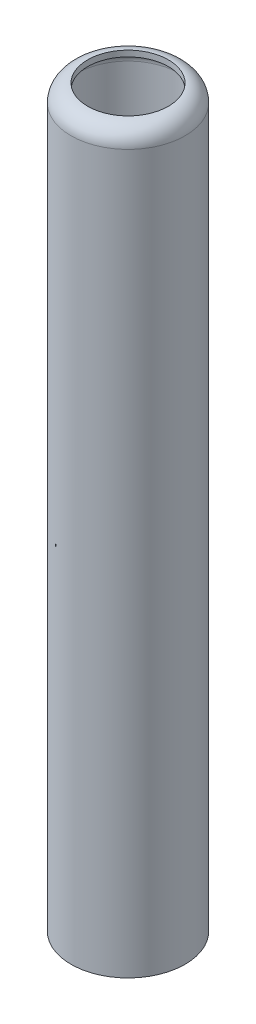
ISO-10303-21;
HEADER;
FILE_DESCRIPTION(('STEP AP214'),'2;1');
FILE_NAME('part.step','',(''),(''),'','','');
FILE_SCHEMA(('AUTOMOTIVE_DESIGN { 1 0 10303 214 1 1 1 1 }'));
ENDSEC;
DATA;
#1=APPLICATION_CONTEXT('core data for automotive mechanical design processes');
#2=APPLICATION_PROTOCOL_DEFINITION('international standard','automotive_design',2000,#1);
#3=PRODUCT_CONTEXT('',#1,'mechanical');
#4=PRODUCT('Part','Part','',(#3));
#5=PRODUCT_RELATED_PRODUCT_CATEGORY('part','',(#4));
#6=PRODUCT_DEFINITION_FORMATION('','',#4);
#7=PRODUCT_DEFINITION_CONTEXT('part definition',#1,'design');
#8=PRODUCT_DEFINITION('design','',#6,#7);
#9=PRODUCT_DEFINITION_SHAPE('','',#8);
#10=(LENGTH_UNIT() NAMED_UNIT(*) SI_UNIT(.MILLI.,.METRE.));
#11=(NAMED_UNIT(*) PLANE_ANGLE_UNIT() SI_UNIT($,.RADIAN.));
#12=(NAMED_UNIT(*) SI_UNIT($,.STERADIAN.) SOLID_ANGLE_UNIT());
#13=UNCERTAINTY_MEASURE_WITH_UNIT(LENGTH_MEASURE(1.E-05),#10,'distance_accuracy_value','');
#14=(GEOMETRIC_REPRESENTATION_CONTEXT(3) GLOBAL_UNCERTAINTY_ASSIGNED_CONTEXT((#13)) GLOBAL_UNIT_ASSIGNED_CONTEXT((#10,
#11,#12)) REPRESENTATION_CONTEXT('',''));
#15=CARTESIAN_POINT('',(0.,0.,0.));
#16=DIRECTION('',(0.,0.,1.));
#17=DIRECTION('',(1.,0.,0.));
#18=AXIS2_PLACEMENT_3D('',#15,#16,#17);
#19=CARTESIAN_POINT('',(0.,186.69,0.));
#20=DIRECTION('',(0.,-1.,0.));
#21=DIRECTION('',(0.,0.,-1.));
#22=AXIS2_PLACEMENT_3D('',#19,#20,#21);
#23=CYLINDRICAL_SURFACE('',#22,14.5);
#24=CARTESIAN_POINT('',(0.,182.324375,0.));
#25=DIRECTION('',(0.,1.,0.));
#26=DIRECTION('',(0.,0.,1.));
#27=AXIS2_PLACEMENT_3D('',#24,#25,#26);
#28=CIRCLE('',#27,14.5);
#29=CARTESIAN_POINT('',(0.,182.324375,-14.5));
#30=VERTEX_POINT('',#29);
#31=EDGE_CURVE('E10',#30,#30,#28,.F.);
#32=CARTESIAN_POINT('',(0.,0.,0.));
#33=DIRECTION('',(0.,1.,0.));
#34=DIRECTION('',(0.,0.,1.));
#35=AXIS2_PLACEMENT_3D('',#32,#33,#34);
#36=CIRCLE('',#35,14.5);
#37=CARTESIAN_POINT('',(0.,0.,-14.5));
#38=VERTEX_POINT('',#37);
#39=EDGE_CURVE('E49',#38,#38,#36,.T.);
#40=CARTESIAN_POINT('',(0.,182.324375,-14.5));
#41=CARTESIAN_POINT('',(0.,180.425162760417,-14.5));
#42=CARTESIAN_POINT('',(0.,178.525950520833,-14.5));
#43=CARTESIAN_POINT('',(0.,174.727526041667,-14.5));
#44=CARTESIAN_POINT('',(0.,172.828313802083,-14.5));
#45=CARTESIAN_POINT('',(0.,169.029889322917,-14.5));
#46=CARTESIAN_POINT('',(0.,167.130677083333,-14.5));
#47=CARTESIAN_POINT('',(0.,163.332252604167,-14.5));
#48=CARTESIAN_POINT('',(0.,161.433040364583,-14.5));
#49=CARTESIAN_POINT('',(0.,157.634615885417,-14.5));
#50=CARTESIAN_POINT('',(0.,155.735403645833,-14.5));
#51=CARTESIAN_POINT('',(0.,151.936979166667,-14.5));
#52=CARTESIAN_POINT('',(0.,150.037766927083,-14.5));
#53=CARTESIAN_POINT('',(0.,146.239342447917,-14.5));
#54=CARTESIAN_POINT('',(0.,144.340130208333,-14.5));
#55=CARTESIAN_POINT('',(0.,140.541705729167,-14.5));
#56=CARTESIAN_POINT('',(0.,138.642493489583,-14.5));
#57=CARTESIAN_POINT('',(0.,134.844069010417,-14.5));
#58=CARTESIAN_POINT('',(0.,132.944856770833,-14.5));
#59=CARTESIAN_POINT('',(0.,129.146432291667,-14.5));
#60=CARTESIAN_POINT('',(0.,127.247220052083,-14.5));
#61=CARTESIAN_POINT('',(0.,123.448795572917,-14.5));
#62=CARTESIAN_POINT('',(0.,121.549583333333,-14.5));
#63=CARTESIAN_POINT('',(0.,117.751158854167,-14.5));
#64=CARTESIAN_POINT('',(0.,115.851946614583,-14.5));
#65=CARTESIAN_POINT('',(0.,112.053522135417,-14.5));
#66=CARTESIAN_POINT('',(0.,110.154309895833,-14.5));
#67=CARTESIAN_POINT('',(0.,106.355885416667,-14.5));
#68=CARTESIAN_POINT('',(0.,104.456673177083,-14.5));
#69=CARTESIAN_POINT('',(0.,100.658248697917,-14.5));
#70=CARTESIAN_POINT('',(0.,98.7590364583333,-14.5));
#71=CARTESIAN_POINT('',(0.,94.9606119791667,-14.5));
#72=CARTESIAN_POINT('',(0.,93.0613997395833,-14.5));
#73=CARTESIAN_POINT('',(0.,89.2629752604167,-14.5));
#74=CARTESIAN_POINT('',(0.,87.3637630208333,-14.5));
#75=CARTESIAN_POINT('',(0.,83.5653385416667,-14.5));
#76=CARTESIAN_POINT('',(0.,81.6661263020833,-14.5));
#77=CARTESIAN_POINT('',(0.,77.8677018229167,-14.5));
#78=CARTESIAN_POINT('',(0.,75.9684895833333,-14.5));
#79=CARTESIAN_POINT('',(0.,72.1700651041667,-14.5));
#80=CARTESIAN_POINT('',(0.,70.2708528645833,-14.5));
#81=CARTESIAN_POINT('',(0.,66.4724283854167,-14.5));
#82=CARTESIAN_POINT('',(0.,64.5732161458333,-14.5));
#83=CARTESIAN_POINT('',(0.,60.7747916666667,-14.5));
#84=CARTESIAN_POINT('',(0.,58.8755794270833,-14.5));
#85=CARTESIAN_POINT('',(0.,55.0771549479167,-14.5));
#86=CARTESIAN_POINT('',(0.,53.1779427083333,-14.5));
#87=CARTESIAN_POINT('',(0.,49.3795182291667,-14.5));
#88=CARTESIAN_POINT('',(0.,47.4803059895833,-14.5));
#89=CARTESIAN_POINT('',(0.,43.6818815104167,-14.5));
#90=CARTESIAN_POINT('',(0.,41.7826692708333,-14.5));
#91=CARTESIAN_POINT('',(0.,37.9842447916667,-14.5));
#92=CARTESIAN_POINT('',(0.,36.0850325520833,-14.5));
#93=CARTESIAN_POINT('',(0.,32.2866080729167,-14.5));
#94=CARTESIAN_POINT('',(0.,30.3873958333333,-14.5));
#95=CARTESIAN_POINT('',(0.,26.5889713541667,-14.5));
#96=CARTESIAN_POINT('',(0.,24.6897591145833,-14.5));
#97=CARTESIAN_POINT('',(0.,20.8913346354167,-14.5));
#98=CARTESIAN_POINT('',(0.,18.9921223958333,-14.5));
#99=CARTESIAN_POINT('',(0.,15.1936979166667,-14.5));
#100=CARTESIAN_POINT('',(0.,13.2944856770833,-14.5));
#101=CARTESIAN_POINT('',(0.,9.49606119791666,-14.5));
#102=CARTESIAN_POINT('',(0.,7.59684895833334,-14.5));
#103=CARTESIAN_POINT('',(0.,3.79842447916667,-14.5));
#104=CARTESIAN_POINT('',(0.,1.89921223958334,-14.5));
#105=CARTESIAN_POINT('',(0.,0.,-14.5));
#106=B_SPLINE_CURVE_WITH_KNOTS('',3,(#40,#41,#42,#43,#44,#45,#46,#47,#48,#49,#50,#51,#52,#53,
#54,#55,#56,#57,#58,#59,#60,#61,#62,#63,#64,#65,#66,#67,#68,#69,#70,#71,#72,#73,#74,#75,#76,#77,
#78,#79,#80,#81,#82,#83,#84,#85,#86,#87,#88,#89,#90,#91,#92,#93,#94,#95,#96,#97,#98,#99,#100,
#101,#102,#103,#104,#105),.UNSPECIFIED.,.F.,.F.,(4,2,2,2,2,2,2,2,2,2,2,2,2,2,2,2,2,2,2,2,2,2,2,
2,2,2,2,2,2,2,2,2,4),(0.,5.69763671874998,11.3952734375,17.09291015625,22.790546875,
28.48818359375,34.1858203125,39.88345703125,45.58109375,51.27873046875,56.9763671875,
62.67400390625,68.371640625,74.06927734375,79.7669140625,85.46455078125,91.1621875,
96.85982421875,102.5574609375,108.25509765625,113.952734375,119.65037109375,125.3480078125,
131.04564453125,136.74328125,142.44091796875,148.1385546875,153.83619140625,159.533828125,
165.23146484375,170.9291015625,176.62673828125,182.324375),.UNSPECIFIED.);
#107=EDGE_CURVE('BSEAM41',#30,#38,#106,.T.);
#108=ORIENTED_EDGE('',*,*,#31,.T.);
#109=ORIENTED_EDGE('',*,*,#39,.T.);
#110=ORIENTED_EDGE('',*,*,#107,.T.);
#111=ORIENTED_EDGE('',*,*,#107,.F.);
#112=EDGE_LOOP('',(#108,#110,#109,#111));
#113=FACE_BOUND('',#112,.T.);
#114=ADVANCED_FACE('F41',(#113),#23,.T.);
#115=CARTESIAN_POINT('',(0.,0.,0.));
#116=DIRECTION('',(0.,1.,0.));
#117=DIRECTION('',(0.,0.,1.));
#118=AXIS2_PLACEMENT_3D('',#115,#116,#117);
#119=PLANE('',#118);
#120=CARTESIAN_POINT('',(0.,0.,0.));
#121=DIRECTION('',(0.,1.,0.));
#122=DIRECTION('',(0.,0.,1.));
#123=AXIS2_PLACEMENT_3D('',#120,#121,#122);
#124=CIRCLE('',#123,13.);
#125=CARTESIAN_POINT('',(0.,0.,-13.));
#126=VERTEX_POINT('',#125);
#127=EDGE_CURVE('E56',#126,#126,#124,.T.);
#128=ORIENTED_EDGE('',*,*,#127,.T.);
#129=EDGE_LOOP('',(#128));
#130=FACE_BOUND('',#129,.T.);
#131=ORIENTED_EDGE('',*,*,#39,.F.);
#132=EDGE_LOOP('',(#131));
#133=FACE_BOUND('',#132,.T.);
#134=ADVANCED_FACE('F81',(#130,#133),#119,.F.);
#135=CARTESIAN_POINT('',(0.,182.324375,0.));
#136=DIRECTION('',(0.,1.,0.));
#137=DIRECTION('',(0.,0.,1.));
#138=AXIS2_PLACEMENT_3D('',#135,#136,#137);
#139=TOROIDAL_SURFACE('',#138,10.134375,4.365625);
#140=CARTESIAN_POINT('',(0.,186.688468548493,0.));
#141=DIRECTION('',(0.,-1.,0.));
#142=DIRECTION('',(0.,0.,-1.));
#143=AXIS2_PLACEMENT_3D('',#140,#141,#142);
#144=CIRCLE('',#143,10.25);
#145=CARTESIAN_POINT('',(0.,186.688468548493,10.25));
#146=VERTEX_POINT('',#145);
#147=EDGE_CURVE('E59',#146,#146,#144,.F.);
#148=ORIENTED_EDGE('',*,*,#147,.F.);
#149=EDGE_LOOP('',(#148));
#150=FACE_BOUND('',#149,.T.);
#151=ORIENTED_EDGE('',*,*,#31,.F.);
#152=EDGE_LOOP('',(#151));
#153=FACE_BOUND('',#152,.T.);
#154=ADVANCED_FACE('F43',(#150,#153),#139,.T.);
#155=CARTESIAN_POINT('',(0.,186.69,0.));
#156=DIRECTION('',(0.,-1.,0.));
#157=DIRECTION('',(0.,0.,-1.));
#158=AXIS2_PLACEMENT_3D('',#155,#156,#157);
#159=CYLINDRICAL_SURFACE('',#158,13.);
#160=CARTESIAN_POINT('',(0.,182.324375,0.));
#161=DIRECTION('',(0.,-1.,0.));
#162=DIRECTION('',(0.,0.,-1.));
#163=AXIS2_PLACEMENT_3D('',#160,#161,#162);
#164=CIRCLE('',#163,13.);
#165=CARTESIAN_POINT('',(0.,182.324375,-13.));
#166=VERTEX_POINT('',#165);
#167=EDGE_CURVE('E53',#166,#166,#164,.T.);
#168=CARTESIAN_POINT('',(0.,182.324375,-13.));
#169=CARTESIAN_POINT('',(0.,180.425162760417,-13.));
#170=CARTESIAN_POINT('',(0.,178.525950520833,-13.));
#171=CARTESIAN_POINT('',(0.,174.727526041667,-13.));
#172=CARTESIAN_POINT('',(0.,172.828313802083,-13.));
#173=CARTESIAN_POINT('',(0.,169.029889322917,-13.));
#174=CARTESIAN_POINT('',(0.,167.130677083333,-13.));
#175=CARTESIAN_POINT('',(0.,163.332252604167,-13.));
#176=CARTESIAN_POINT('',(0.,161.433040364583,-13.));
#177=CARTESIAN_POINT('',(0.,157.634615885417,-13.));
#178=CARTESIAN_POINT('',(0.,155.735403645833,-13.));
#179=CARTESIAN_POINT('',(0.,151.936979166667,-13.));
#180=CARTESIAN_POINT('',(0.,150.037766927083,-13.));
#181=CARTESIAN_POINT('',(0.,146.239342447917,-13.));
#182=CARTESIAN_POINT('',(0.,144.340130208333,-13.));
#183=CARTESIAN_POINT('',(0.,140.541705729167,-13.));
#184=CARTESIAN_POINT('',(0.,138.642493489583,-13.));
#185=CARTESIAN_POINT('',(0.,134.844069010417,-13.));
#186=CARTESIAN_POINT('',(0.,132.944856770833,-13.));
#187=CARTESIAN_POINT('',(0.,129.146432291667,-13.));
#188=CARTESIAN_POINT('',(0.,127.247220052083,-13.));
#189=CARTESIAN_POINT('',(0.,123.448795572917,-13.));
#190=CARTESIAN_POINT('',(0.,121.549583333333,-13.));
#191=CARTESIAN_POINT('',(0.,117.751158854167,-13.));
#192=CARTESIAN_POINT('',(0.,115.851946614583,-13.));
#193=CARTESIAN_POINT('',(0.,112.053522135417,-13.));
#194=CARTESIAN_POINT('',(0.,110.154309895833,-13.));
#195=CARTESIAN_POINT('',(0.,106.355885416667,-13.));
#196=CARTESIAN_POINT('',(0.,104.456673177083,-13.));
#197=CARTESIAN_POINT('',(0.,100.658248697917,-13.));
#198=CARTESIAN_POINT('',(0.,98.7590364583333,-13.));
#199=CARTESIAN_POINT('',(0.,94.9606119791667,-13.));
#200=CARTESIAN_POINT('',(0.,93.0613997395833,-13.));
#201=CARTESIAN_POINT('',(0.,89.2629752604167,-13.));
#202=CARTESIAN_POINT('',(0.,87.3637630208333,-13.));
#203=CARTESIAN_POINT('',(0.,83.5653385416667,-13.));
#204=CARTESIAN_POINT('',(0.,81.6661263020833,-13.));
#205=CARTESIAN_POINT('',(0.,77.8677018229166,-13.));
#206=CARTESIAN_POINT('',(0.,75.9684895833333,-13.));
#207=CARTESIAN_POINT('',(0.,72.1700651041667,-13.));
#208=CARTESIAN_POINT('',(0.,70.2708528645833,-13.));
#209=CARTESIAN_POINT('',(0.,66.4724283854166,-13.));
#210=CARTESIAN_POINT('',(0.,64.5732161458333,-13.));
#211=CARTESIAN_POINT('',(0.,60.7747916666667,-13.));
#212=CARTESIAN_POINT('',(0.,58.8755794270833,-13.));
#213=CARTESIAN_POINT('',(0.,55.0771549479167,-13.));
#214=CARTESIAN_POINT('',(0.,53.1779427083333,-13.));
#215=CARTESIAN_POINT('',(0.,49.3795182291667,-13.));
#216=CARTESIAN_POINT('',(0.,47.4803059895833,-13.));
#217=CARTESIAN_POINT('',(0.,43.6818815104167,-13.));
#218=CARTESIAN_POINT('',(0.,41.7826692708334,-13.));
#219=CARTESIAN_POINT('',(0.,37.9842447916667,-13.));
#220=CARTESIAN_POINT('',(0.,36.0850325520833,-13.));
#221=CARTESIAN_POINT('',(0.,32.2866080729167,-13.));
#222=CARTESIAN_POINT('',(0.,30.3873958333333,-13.));
#223=CARTESIAN_POINT('',(0.,26.5889713541667,-13.));
#224=CARTESIAN_POINT('',(0.,24.6897591145833,-13.));
#225=CARTESIAN_POINT('',(0.,20.8913346354166,-13.));
#226=CARTESIAN_POINT('',(0.,18.9921223958333,-13.));
#227=CARTESIAN_POINT('',(0.,15.1936979166666,-13.));
#228=CARTESIAN_POINT('',(0.,13.2944856770833,-13.));
#229=CARTESIAN_POINT('',(0.,9.49606119791665,-13.));
#230=CARTESIAN_POINT('',(0.,7.59684895833333,-13.));
#231=CARTESIAN_POINT('',(0.,3.79842447916667,-13.));
#232=CARTESIAN_POINT('',(0.,1.89921223958333,-13.));
#233=CARTESIAN_POINT('',(0.,0.,-13.));
#234=B_SPLINE_CURVE_WITH_KNOTS('',3,(#168,#169,#170,#171,#172,#173,#174,#175,#176,#177,#178,
#179,#180,#181,#182,#183,#184,#185,#186,#187,#188,#189,#190,#191,#192,#193,#194,#195,#196,#197,
#198,#199,#200,#201,#202,#203,#204,#205,#206,#207,#208,#209,#210,#211,#212,#213,#214,#215,#216,
#217,#218,#219,#220,#221,#222,#223,#224,#225,#226,#227,#228,#229,#230,#231,#232,#233),
.UNSPECIFIED.,.F.,.F.,(4,2,2,2,2,2,2,2,2,2,2,2,2,2,2,2,2,2,2,2,2,2,2,2,2,2,2,2,2,2,2,2,4),(0.,
5.69763671875001,11.3952734375,17.09291015625,22.790546875,28.48818359375,34.1858203125,
39.88345703125,45.58109375,51.27873046875,56.9763671875,62.67400390625,68.371640625,
74.06927734375,79.7669140625,85.46455078125,91.1621875,96.85982421875,102.5574609375,
108.25509765625,113.952734375,119.65037109375,125.3480078125,131.04564453125,136.74328125,
142.44091796875,148.1385546875,153.83619140625,159.533828125,165.23146484375,170.9291015625,
176.62673828125,182.324375),.UNSPECIFIED.);
#235=EDGE_CURVE('BSEAM77',#166,#126,#234,.T.);
#236=ORIENTED_EDGE('',*,*,#167,.F.);
#237=ORIENTED_EDGE('',*,*,#127,.F.);
#238=ORIENTED_EDGE('',*,*,#235,.T.);
#239=ORIENTED_EDGE('',*,*,#235,.F.);
#240=EDGE_LOOP('',(#236,#238,#237,#239));
#241=FACE_BOUND('',#240,.T.);
#242=ADVANCED_FACE('F77',(#241),#159,.F.);
#243=CARTESIAN_POINT('',(0.,182.324375,0.));
#244=DIRECTION('',(0.,1.,0.));
#245=DIRECTION('',(0.,0.,1.));
#246=AXIS2_PLACEMENT_3D('',#243,#244,#245);
#247=TOROIDAL_SURFACE('',#246,10.134375,2.865625);
#248=CARTESIAN_POINT('',(0.,185.187666375323,0.));
#249=DIRECTION('',(0.,-1.,0.));
#250=DIRECTION('',(0.,0.,-1.));
#251=AXIS2_PLACEMENT_3D('',#248,#249,#250);
#252=CIRCLE('',#251,10.25);
#253=CARTESIAN_POINT('',(0.,185.187666375323,10.25));
#254=VERTEX_POINT('',#253);
#255=EDGE_CURVE('E45',#254,#254,#252,.F.);
#256=ORIENTED_EDGE('',*,*,#255,.T.);
#257=EDGE_LOOP('',(#256));
#258=FACE_BOUND('',#257,.T.);
#259=ORIENTED_EDGE('',*,*,#167,.T.);
#260=EDGE_LOOP('',(#259));
#261=FACE_BOUND('',#260,.T.);
#262=ADVANCED_FACE('F68',(#258,#261),#247,.F.);
#263=CARTESIAN_POINT('',(0.,-1.2E-05,0.));
#264=DIRECTION('',(0.,1.,0.));
#265=DIRECTION('',(0.,0.,1.));
#266=AXIS2_PLACEMENT_3D('',#263,#264,#265);
#267=CYLINDRICAL_SURFACE('',#266,10.25);
#268=CARTESIAN_POINT('',(0.,186.688468548493,10.25));
#269=CARTESIAN_POINT('',(0.,186.672835192523,10.25));
#270=CARTESIAN_POINT('',(0.,186.657201836552,10.25));
#271=CARTESIAN_POINT('',(0.,186.625935124611,10.25));
#272=CARTESIAN_POINT('',(0.,186.610301768641,10.25));
#273=CARTESIAN_POINT('',(0.,186.5790350567,10.25));
#274=CARTESIAN_POINT('',(0.,186.563401700729,10.25));
#275=CARTESIAN_POINT('',(0.,186.532134988788,10.25));
#276=CARTESIAN_POINT('',(0.,186.516501632817,10.25));
#277=CARTESIAN_POINT('',(0.,186.485234920876,10.25));
#278=CARTESIAN_POINT('',(0.,186.469601564906,10.25));
#279=CARTESIAN_POINT('',(0.,186.438334852965,10.25));
#280=CARTESIAN_POINT('',(0.,186.422701496994,10.25));
#281=CARTESIAN_POINT('',(0.,186.391434785053,10.25));
#282=CARTESIAN_POINT('',(0.,186.375801429083,10.25));
#283=CARTESIAN_POINT('',(0.,186.344534717142,10.25));
#284=CARTESIAN_POINT('',(0.,186.328901361171,10.25));
#285=CARTESIAN_POINT('',(0.,186.29763464923,10.25));
#286=CARTESIAN_POINT('',(0.,186.28200129326,10.25));
#287=CARTESIAN_POINT('',(0.,186.250734581319,10.25));
#288=CARTESIAN_POINT('',(0.,186.235101225348,10.25));
#289=CARTESIAN_POINT('',(0.,186.203834513407,10.25));
#290=CARTESIAN_POINT('',(0.,186.188201157437,10.25));
#291=CARTESIAN_POINT('',(0.,186.156934445495,10.25));
#292=CARTESIAN_POINT('',(0.,186.141301089525,10.25));
#293=CARTESIAN_POINT('',(0.,186.110034377584,10.25));
#294=CARTESIAN_POINT('',(0.,186.094401021613,10.25));
#295=CARTESIAN_POINT('',(0.,186.063134309672,10.25));
#296=CARTESIAN_POINT('',(0.,186.047500953702,10.25));
#297=CARTESIAN_POINT('',(0.,186.016234241761,10.25));
#298=CARTESIAN_POINT('',(0.,186.00060088579,10.25));
#299=CARTESIAN_POINT('',(0.,185.969334173849,10.25));
#300=CARTESIAN_POINT('',(0.,185.953700817879,10.25));
#301=CARTESIAN_POINT('',(0.,185.922434105938,10.25));
#302=CARTESIAN_POINT('',(0.,185.906800749967,10.25));
#303=CARTESIAN_POINT('',(0.,185.875534038026,10.25));
#304=CARTESIAN_POINT('',(0.,185.859900682056,10.25));
#305=CARTESIAN_POINT('',(0.,185.828633970115,10.25));
#306=CARTESIAN_POINT('',(0.,185.813000614144,10.25));
#307=CARTESIAN_POINT('',(0.,185.781733902203,10.25));
#308=CARTESIAN_POINT('',(0.,185.766100546232,10.25));
#309=CARTESIAN_POINT('',(0.,185.734833834291,10.25));
#310=CARTESIAN_POINT('',(0.,185.719200478321,10.25));
#311=CARTESIAN_POINT('',(0.,185.68793376638,10.25));
#312=CARTESIAN_POINT('',(0.,185.672300410409,10.25));
#313=CARTESIAN_POINT('',(0.,185.641033698468,10.25));
#314=CARTESIAN_POINT('',(0.,185.625400342498,10.25));
#315=CARTESIAN_POINT('',(0.,185.594133630557,10.25));
#316=CARTESIAN_POINT('',(0.,185.578500274586,10.25));
#317=CARTESIAN_POINT('',(0.,185.547233562645,10.25));
#318=CARTESIAN_POINT('',(0.,185.531600206675,10.25));
#319=CARTESIAN_POINT('',(0.,185.500333494734,10.25));
#320=CARTESIAN_POINT('',(0.,185.484700138763,10.25));
#321=CARTESIAN_POINT('',(0.,185.453433426822,10.25));
#322=CARTESIAN_POINT('',(0.,185.437800070851,10.25));
#323=CARTESIAN_POINT('',(0.,185.40653335891,10.25));
#324=CARTESIAN_POINT('',(0.,185.39090000294,10.25));
#325=CARTESIAN_POINT('',(0.,185.359633290999,10.25));
#326=CARTESIAN_POINT('',(0.,185.343999935028,10.25));
#327=CARTESIAN_POINT('',(0.,185.312733223087,10.25));
#328=CARTESIAN_POINT('',(0.,185.297099867117,10.25));
#329=CARTESIAN_POINT('',(0.,185.265833155176,10.25));
#330=CARTESIAN_POINT('',(0.,185.250199799205,10.25));
#331=CARTESIAN_POINT('',(0.,185.218933087264,10.25));
#332=CARTESIAN_POINT('',(0.,185.203299731294,10.25));
#333=CARTESIAN_POINT('',(0.,185.187666375323,10.25));
#334=B_SPLINE_CURVE_WITH_KNOTS('',3,(#268,#269,#270,#271,#272,#273,#274,#275,#276,#277,#278,
#279,#280,#281,#282,#283,#284,#285,#286,#287,#288,#289,#290,#291,#292,#293,#294,#295,#296,#297,
#298,#299,#300,#301,#302,#303,#304,#305,#306,#307,#308,#309,#310,#311,#312,#313,#314,#315,#316,
#317,#318,#319,#320,#321,#322,#323,#324,#325,#326,#327,#328,#329,#330,#331,#332,#333),
.UNSPECIFIED.,.F.,.F.,(4,2,2,2,2,2,2,2,2,2,2,2,2,2,2,2,2,2,2,2,2,2,2,2,2,2,2,2,2,2,2,2,4),(0.,
0.0469000679115539,0.0938001358231355,0.140700203734689,0.187600271646271,0.234500339557825,
0.281400407469379,0.32830047538096,0.375200543292514,0.422100611204068,0.46900067911565,
0.515900747027204,0.562800814938758,0.609700882850339,0.656600950761893,0.703501018673475,
0.750401086585029,0.797301154496582,0.844201222408164,0.891101290319718,0.9380013582313,
0.984901426142853,1.03180149405441,1.07870156196599,1.12560162987754,1.1725016977891,
1.21940176570068,1.26630183361223,1.31320190152379,1.36010196943537,1.40700203734692,
1.4539021052585,1.50080217317006),.UNSPECIFIED.);
#335=EDGE_CURVE('BSEAM71',#146,#254,#334,.T.);
#336=ORIENTED_EDGE('',*,*,#147,.T.);
#337=ORIENTED_EDGE('',*,*,#255,.F.);
#338=ORIENTED_EDGE('',*,*,#335,.T.);
#339=ORIENTED_EDGE('',*,*,#335,.F.);
#340=EDGE_LOOP('',(#336,#338,#337,#339));
#341=FACE_BOUND('',#340,.T.);
#342=ADVANCED_FACE('F71',(#341),#267,.F.);
#343=CLOSED_SHELL('',(#114,#134,#154,#242,#262,#342));
#344=MANIFOLD_SOLID_BREP('B2',#343);
#345=ADVANCED_BREP_SHAPE_REPRESENTATION('',(#18,#344),#14);
#346=SHAPE_DEFINITION_REPRESENTATION(#9,#345);
ENDSEC;
END-ISO-10303-21;
